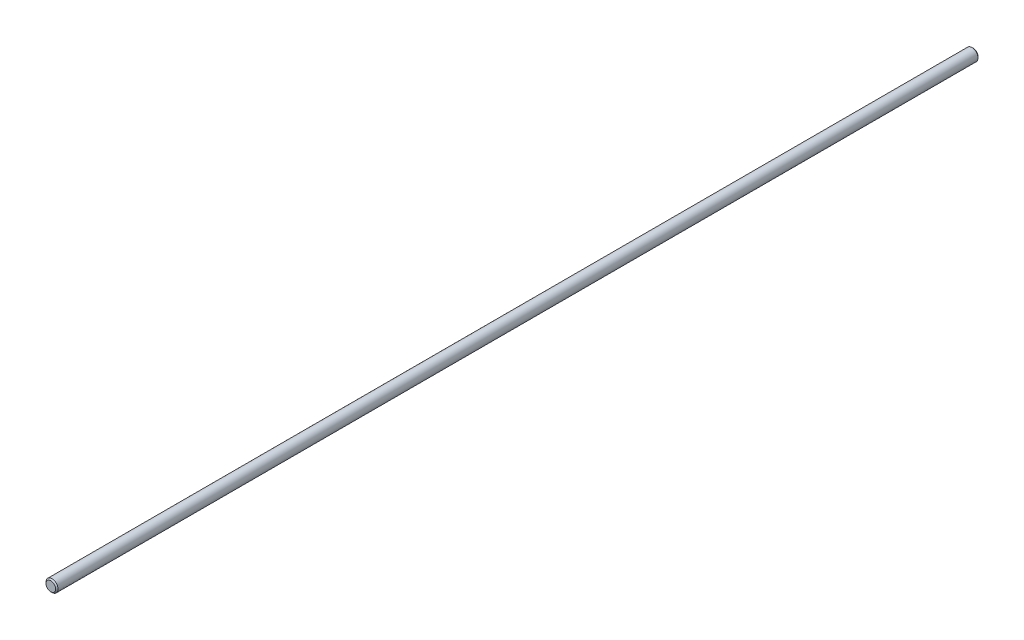
ISO-10303-21;
HEADER;
FILE_DESCRIPTION(('STEP AP214'),'2;1');
FILE_NAME('part.step','',(''),(''),'','','');
FILE_SCHEMA(('AUTOMOTIVE_DESIGN { 1 0 10303 214 1 1 1 1 }'));
ENDSEC;
DATA;
#1=APPLICATION_CONTEXT('core data for automotive mechanical design processes');
#2=APPLICATION_PROTOCOL_DEFINITION('international standard','automotive_design',2000,#1);
#3=PRODUCT_CONTEXT('',#1,'mechanical');
#4=PRODUCT('Part','Part','',(#3));
#5=PRODUCT_RELATED_PRODUCT_CATEGORY('part','',(#4));
#6=PRODUCT_DEFINITION_FORMATION('','',#4);
#7=PRODUCT_DEFINITION_CONTEXT('part definition',#1,'design');
#8=PRODUCT_DEFINITION('design','',#6,#7);
#9=PRODUCT_DEFINITION_SHAPE('','',#8);
#10=(LENGTH_UNIT() NAMED_UNIT(*) SI_UNIT(.MILLI.,.METRE.));
#11=(NAMED_UNIT(*) PLANE_ANGLE_UNIT() SI_UNIT($,.RADIAN.));
#12=(NAMED_UNIT(*) SI_UNIT($,.STERADIAN.) SOLID_ANGLE_UNIT());
#13=UNCERTAINTY_MEASURE_WITH_UNIT(LENGTH_MEASURE(1.E-05),#10,'distance_accuracy_value','');
#14=(GEOMETRIC_REPRESENTATION_CONTEXT(3) GLOBAL_UNCERTAINTY_ASSIGNED_CONTEXT((#13)) GLOBAL_UNIT_ASSIGNED_CONTEXT((#10,
#11,#12)) REPRESENTATION_CONTEXT('',''));
#15=CARTESIAN_POINT('',(0.,0.,0.));
#16=DIRECTION('',(0.,0.,1.));
#17=DIRECTION('',(1.,0.,0.));
#18=AXIS2_PLACEMENT_3D('',#15,#16,#17);
#19=CARTESIAN_POINT('',(0.,0.,304.8));
#20=DIRECTION('',(0.,0.,-1.));
#21=DIRECTION('',(-1.,0.,0.));
#22=AXIS2_PLACEMENT_3D('',#19,#20,#21);
#23=CYLINDRICAL_SURFACE('',#22,3.96875);
#24=CARTESIAN_POINT('',(0.,0.,304.00625));
#25=DIRECTION('',(0.,0.,1.));
#26=DIRECTION('',(1.,0.,0.));
#27=AXIS2_PLACEMENT_3D('',#24,#25,#26);
#28=CIRCLE('',#27,3.96875);
#29=CARTESIAN_POINT('',(3.96875,0.,304.00625));
#30=VERTEX_POINT('',#29);
#31=EDGE_CURVE('E46',#30,#30,#28,.F.);
#32=ORIENTED_EDGE('',*,*,#31,.T.);
#33=EDGE_LOOP('',(#32));
#34=FACE_BOUND('',#33,.T.);
#35=CARTESIAN_POINT('',(0.,0.,-304.00625));
#36=DIRECTION('',(0.,0.,1.));
#37=DIRECTION('',(1.,0.,0.));
#38=AXIS2_PLACEMENT_3D('',#35,#36,#37);
#39=CIRCLE('',#38,3.96875);
#40=CARTESIAN_POINT('',(3.96875,0.,-304.00625));
#41=VERTEX_POINT('',#40);
#42=EDGE_CURVE('E51',#41,#41,#39,.T.);
#43=ORIENTED_EDGE('',*,*,#42,.T.);
#44=EDGE_LOOP('',(#43));
#45=FACE_BOUND('',#44,.T.);
#46=ADVANCED_FACE('F38',(#34,#45),#23,.T.);
#47=CARTESIAN_POINT('',(0.,0.,304.8));
#48=DIRECTION('',(0.,0.,1.));
#49=DIRECTION('',(1.,0.,0.));
#50=AXIS2_PLACEMENT_3D('',#47,#48,#49);
#51=PLANE('',#50);
#52=CARTESIAN_POINT('',(0.,0.,304.8));
#53=DIRECTION('',(0.,0.,1.));
#54=DIRECTION('',(1.,0.,0.));
#55=AXIS2_PLACEMENT_3D('',#52,#53,#54);
#56=CIRCLE('',#55,3.17500000000026);
#57=CARTESIAN_POINT('',(3.17500000000026,0.,304.8));
#58=VERTEX_POINT('',#57);
#59=EDGE_CURVE('E56',#58,#58,#56,.T.);
#60=ORIENTED_EDGE('',*,*,#59,.T.);
#61=EDGE_LOOP('',(#60));
#62=FACE_BOUND('',#61,.T.);
#63=ADVANCED_FACE('F63',(#62),#51,.T.);
#64=CARTESIAN_POINT('',(0.,0.,-304.8));
#65=DIRECTION('',(0.,0.,1.));
#66=DIRECTION('',(1.,0.,0.));
#67=AXIS2_PLACEMENT_3D('',#64,#65,#66);
#68=PLANE('',#67);
#69=CARTESIAN_POINT('',(0.,0.,-304.8));
#70=DIRECTION('',(0.,0.,1.));
#71=DIRECTION('',(1.,0.,0.));
#72=AXIS2_PLACEMENT_3D('',#69,#70,#71);
#73=CIRCLE('',#72,3.17499999999954);
#74=CARTESIAN_POINT('',(3.17499999999954,0.,-304.8));
#75=VERTEX_POINT('',#74);
#76=EDGE_CURVE('E10',#75,#75,#73,.F.);
#77=ORIENTED_EDGE('',*,*,#76,.T.);
#78=EDGE_LOOP('',(#77));
#79=FACE_BOUND('',#78,.T.);
#80=ADVANCED_FACE('F67',(#79),#68,.F.);
#81=CARTESIAN_POINT('',(0.,0.,304.8));
#82=DIRECTION('',(0.,0.,-1.));
#83=DIRECTION('',(-1.,0.,0.));
#84=AXIS2_PLACEMENT_3D('',#81,#82,#83);
#85=CONICAL_SURFACE('',#84,3.17500000000026,0.785398163397436);
#86=ORIENTED_EDGE('',*,*,#31,.F.);
#87=EDGE_LOOP('',(#86));
#88=FACE_BOUND('',#87,.T.);
#89=ORIENTED_EDGE('',*,*,#59,.F.);
#90=EDGE_LOOP('',(#89));
#91=FACE_BOUND('',#90,.T.);
#92=ADVANCED_FACE('F65',(#88,#91),#85,.T.);
#93=CARTESIAN_POINT('',(0.,0.,-304.00625));
#94=DIRECTION('',(0.,0.,1.));
#95=DIRECTION('',(1.,0.,0.));
#96=AXIS2_PLACEMENT_3D('',#93,#94,#95);
#97=CONICAL_SURFACE('',#96,3.96875,0.785398163397436);
#98=ORIENTED_EDGE('',*,*,#76,.F.);
#99=EDGE_LOOP('',(#98));
#100=FACE_BOUND('',#99,.T.);
#101=ORIENTED_EDGE('',*,*,#42,.F.);
#102=EDGE_LOOP('',(#101));
#103=FACE_BOUND('',#102,.T.);
#104=ADVANCED_FACE('F40',(#100,#103),#97,.T.);
#105=CLOSED_SHELL('',(#46,#63,#80,#92,#104));
#106=MANIFOLD_SOLID_BREP('B2',#105);
#107=ADVANCED_BREP_SHAPE_REPRESENTATION('',(#18,#106),#14);
#108=SHAPE_DEFINITION_REPRESENTATION(#9,#107);
ENDSEC;
END-ISO-10303-21;
